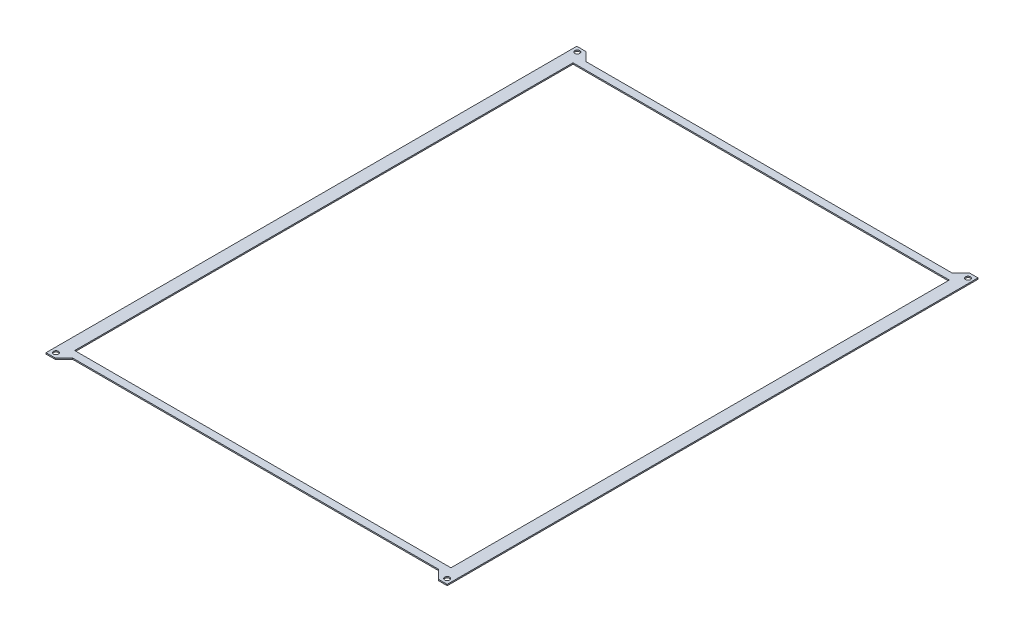
ISO-10303-21;
HEADER;
FILE_DESCRIPTION(('STEP AP214'),'2;1');
FILE_NAME('part.step','',(''),(''),'','','');
FILE_SCHEMA(('AUTOMOTIVE_DESIGN { 1 0 10303 214 1 1 1 1 }'));
ENDSEC;
DATA;
#1=APPLICATION_CONTEXT('core data for automotive mechanical design processes');
#2=APPLICATION_PROTOCOL_DEFINITION('international standard','automotive_design',2000,#1);
#3=PRODUCT_CONTEXT('',#1,'mechanical');
#4=PRODUCT('Part','Part','',(#3));
#5=PRODUCT_RELATED_PRODUCT_CATEGORY('part','',(#4));
#6=PRODUCT_DEFINITION_FORMATION('','',#4);
#7=PRODUCT_DEFINITION_CONTEXT('part definition',#1,'design');
#8=PRODUCT_DEFINITION('design','',#6,#7);
#9=PRODUCT_DEFINITION_SHAPE('','',#8);
#10=(LENGTH_UNIT() NAMED_UNIT(*) SI_UNIT(.MILLI.,.METRE.));
#11=(NAMED_UNIT(*) PLANE_ANGLE_UNIT() SI_UNIT($,.RADIAN.));
#12=(NAMED_UNIT(*) SI_UNIT($,.STERADIAN.) SOLID_ANGLE_UNIT());
#13=UNCERTAINTY_MEASURE_WITH_UNIT(LENGTH_MEASURE(1.E-05),#10,'distance_accuracy_value','');
#14=(GEOMETRIC_REPRESENTATION_CONTEXT(3) GLOBAL_UNCERTAINTY_ASSIGNED_CONTEXT((#13)) GLOBAL_UNIT_ASSIGNED_CONTEXT((#10,
#11,#12)) REPRESENTATION_CONTEXT('',''));
#15=CARTESIAN_POINT('',(0.,0.,0.));
#16=DIRECTION('',(0.,0.,1.));
#17=DIRECTION('',(1.,0.,0.));
#18=AXIS2_PLACEMENT_3D('',#15,#16,#17);
#19=CARTESIAN_POINT('',(0.,0.5,0.));
#20=DIRECTION('',(0.,-1.,0.));
#21=DIRECTION('',(0.,0.,-1.));
#22=AXIS2_PLACEMENT_3D('',#19,#20,#21);
#23=PLANE('',#22);
#24=CARTESIAN_POINT('',(78.6297530458882,0.5,-104.402403880096));
#25=DIRECTION('',(0.,1.,0.));
#26=DIRECTION('',(0.,0.,-1.));
#27=AXIS2_PLACEMENT_3D('',#24,#25,#26);
#28=CIRCLE('',#27,0.999999999999989);
#29=CARTESIAN_POINT('',(78.6297530458882,0.5,-105.402403880096));
#30=VERTEX_POINT('',#29);
#31=EDGE_CURVE('E534',#30,#30,#28,.T.);
#32=ORIENTED_EDGE('',*,*,#31,.F.);
#33=EDGE_LOOP('',(#32));
#34=FACE_BOUND('',#33,.T.);
#35=CARTESIAN_POINT('',(-78.5,0.5,104.5));
#36=DIRECTION('',(0.,1.,0.));
#37=DIRECTION('',(0.,0.,1.));
#38=AXIS2_PLACEMENT_3D('',#35,#36,#37);
#39=CIRCLE('',#38,0.999999999999998);
#40=CARTESIAN_POINT('',(-78.5,0.5,105.5));
#41=VERTEX_POINT('',#40);
#42=EDGE_CURVE('E177',#41,#41,#39,.T.);
#43=ORIENTED_EDGE('',*,*,#42,.F.);
#44=EDGE_LOOP('',(#43));
#45=FACE_BOUND('',#44,.T.);
#46=DIRECTION('',(-1.,0.,0.));
#47=VECTOR('',#46,1.);
#48=CARTESIAN_POINT('',(-80.5,0.5,-106.5));
#49=LINE('',#48,#47);
#50=CARTESIAN_POINT('',(-76.9,0.5,-106.5));
#51=VERTEX_POINT('',#50);
#52=CARTESIAN_POINT('',(-80.5,0.5,-106.5));
#53=VERTEX_POINT('',#52);
#54=EDGE_CURVE('E187',#51,#53,#49,.T.);
#55=ORIENTED_EDGE('',*,*,#54,.T.);
#56=DIRECTION('',(0.,0.,1.));
#57=VECTOR('',#56,1.);
#58=CARTESIAN_POINT('',(-80.5,0.5,106.4));
#59=LINE('',#58,#57);
#60=CARTESIAN_POINT('',(-80.5,0.5,106.5));
#61=VERTEX_POINT('',#60);
#62=EDGE_CURVE('E190',#53,#61,#59,.T.);
#63=ORIENTED_EDGE('',*,*,#62,.T.);
#64=DIRECTION('',(1.,0.,2.77555756156243E-13));
#65=VECTOR('',#64,1.);
#66=CARTESIAN_POINT('',(-80.5,0.5,106.5));
#67=LINE('',#66,#65);
#68=CARTESIAN_POINT('',(-76.9,0.5,106.5));
#69=VERTEX_POINT('',#68);
#70=EDGE_CURVE('E193',#61,#69,#67,.T.);
#71=ORIENTED_EDGE('',*,*,#70,.T.);
#72=DIRECTION('',(0.707106781186546,0.,-0.707106781186549));
#73=VECTOR('',#72,1.);
#74=CARTESIAN_POINT('',(-73.4,0.5,103.));
#75=LINE('',#74,#73);
#76=CARTESIAN_POINT('',(-73.4,0.5,103.));
#77=VERTEX_POINT('',#76);
#78=EDGE_CURVE('E195',#69,#77,#75,.T.);
#79=ORIENTED_EDGE('',*,*,#78,.T.);
#80=DIRECTION('',(1.,0.,0.));
#81=VECTOR('',#80,1.);
#82=CARTESIAN_POINT('',(73.5,0.5,103.));
#83=LINE('',#82,#81);
#84=CARTESIAN_POINT('',(73.5,0.5,103.));
#85=VERTEX_POINT('',#84);
#86=EDGE_CURVE('E197',#77,#85,#83,.T.);
#87=ORIENTED_EDGE('',*,*,#86,.T.);
#88=DIRECTION('',(0.707106781186547,0.,0.707106781186547));
#89=VECTOR('',#88,1.);
#90=CARTESIAN_POINT('',(77.,0.5,106.5));
#91=LINE('',#90,#89);
#92=CARTESIAN_POINT('',(77.,0.5,106.5));
#93=VERTEX_POINT('',#92);
#94=EDGE_CURVE('E199',#85,#93,#91,.T.);
#95=ORIENTED_EDGE('',*,*,#94,.T.);
#96=DIRECTION('',(1.,0.,0.));
#97=VECTOR('',#96,1.);
#98=CARTESIAN_POINT('',(80.5,0.5,106.5));
#99=LINE('',#98,#97);
#100=CARTESIAN_POINT('',(80.5,0.5,106.5));
#101=VERTEX_POINT('',#100);
#102=EDGE_CURVE('E201',#93,#101,#99,.T.);
#103=ORIENTED_EDGE('',*,*,#102,.T.);
#104=DIRECTION('',(0.,0.,-1.));
#105=VECTOR('',#104,1.);
#106=CARTESIAN_POINT('',(80.5,0.5,-106.5));
#107=LINE('',#106,#105);
#108=CARTESIAN_POINT('',(80.5,0.5,-106.5));
#109=VERTEX_POINT('',#108);
#110=EDGE_CURVE('E203',#101,#109,#107,.T.);
#111=ORIENTED_EDGE('',*,*,#110,.T.);
#112=DIRECTION('',(-1.,0.,0.));
#113=VECTOR('',#112,1.);
#114=CARTESIAN_POINT('',(77.,0.5,-106.5));
#115=LINE('',#114,#113);
#116=CARTESIAN_POINT('',(77.,0.5,-106.5));
#117=VERTEX_POINT('',#116);
#118=EDGE_CURVE('E205',#109,#117,#115,.T.);
#119=ORIENTED_EDGE('',*,*,#118,.T.);
#120=DIRECTION('',(-0.707106781186547,0.,0.707106781186547));
#121=VECTOR('',#120,1.);
#122=CARTESIAN_POINT('',(73.5,0.5,-103.));
#123=LINE('',#122,#121);
#124=CARTESIAN_POINT('',(73.5,0.5,-103.));
#125=VERTEX_POINT('',#124);
#126=EDGE_CURVE('E207',#117,#125,#123,.T.);
#127=ORIENTED_EDGE('',*,*,#126,.T.);
#128=DIRECTION('',(-1.,0.,0.));
#129=VECTOR('',#128,1.);
#130=CARTESIAN_POINT('',(-73.4,0.5,-103.));
#131=LINE('',#130,#129);
#132=CARTESIAN_POINT('',(-73.4,0.5,-103.));
#133=VERTEX_POINT('',#132);
#134=EDGE_CURVE('E209',#125,#133,#131,.T.);
#135=ORIENTED_EDGE('',*,*,#134,.T.);
#136=DIRECTION('',(-0.707106781186549,0.,-0.707106781186546));
#137=VECTOR('',#136,1.);
#138=CARTESIAN_POINT('',(-76.9,0.5,-106.5));
#139=LINE('',#138,#137);
#140=EDGE_CURVE('E211',#133,#51,#139,.T.);
#141=ORIENTED_EDGE('',*,*,#140,.T.);
#142=EDGE_LOOP('',(#55,#63,#71,#79,#87,#95,#103,#111,#119,#127,#135,#141));
#143=FACE_BOUND('',#142,.T.);
#144=DIRECTION('',(0.,0.,1.));
#145=VECTOR('',#144,1.);
#146=CARTESIAN_POINT('',(-75.5,0.5,100.));
#147=LINE('',#146,#145);
#148=CARTESIAN_POINT('',(-75.5,0.5,-100.));
#149=VERTEX_POINT('',#148);
#150=CARTESIAN_POINT('',(-75.5,0.5,100.));
#151=VERTEX_POINT('',#150);
#152=EDGE_CURVE('E148',#149,#151,#147,.T.);
#153=ORIENTED_EDGE('',*,*,#152,.F.);
#154=DIRECTION('',(-1.,0.,0.));
#155=VECTOR('',#154,1.);
#156=CARTESIAN_POINT('',(-75.5,0.5,-100.));
#157=LINE('',#156,#155);
#158=CARTESIAN_POINT('',(75.5,0.5,-100.));
#159=VERTEX_POINT('',#158);
#160=EDGE_CURVE('E171',#159,#149,#157,.T.);
#161=ORIENTED_EDGE('',*,*,#160,.F.);
#162=DIRECTION('',(0.,0.,-1.));
#163=VECTOR('',#162,1.);
#164=CARTESIAN_POINT('',(75.5,0.5,-100.));
#165=LINE('',#164,#163);
#166=CARTESIAN_POINT('',(75.5,0.5,100.));
#167=VERTEX_POINT('',#166);
#168=EDGE_CURVE('E169',#167,#159,#165,.T.);
#169=ORIENTED_EDGE('',*,*,#168,.F.);
#170=DIRECTION('',(1.,0.,0.));
#171=VECTOR('',#170,1.);
#172=CARTESIAN_POINT('',(75.5,0.5,100.));
#173=LINE('',#172,#171);
#174=EDGE_CURVE('E156',#151,#167,#173,.T.);
#175=ORIENTED_EDGE('',*,*,#174,.F.);
#176=EDGE_LOOP('',(#153,#161,#169,#175));
#177=FACE_BOUND('',#176,.T.);
#178=CARTESIAN_POINT('',(78.5,0.5,104.5));
#179=DIRECTION('',(0.,1.,0.));
#180=DIRECTION('',(0.,0.,1.));
#181=AXIS2_PLACEMENT_3D('',#178,#179,#180);
#182=CIRCLE('',#181,0.999999999999998);
#183=CARTESIAN_POINT('',(78.5,0.5,105.5));
#184=VERTEX_POINT('',#183);
#185=EDGE_CURVE('E540',#184,#184,#182,.T.);
#186=ORIENTED_EDGE('',*,*,#185,.F.);
#187=EDGE_LOOP('',(#186));
#188=FACE_BOUND('',#187,.T.);
#189=CARTESIAN_POINT('',(-78.3701258168567,0.5,-104.597434860756));
#190=DIRECTION('',(0.,1.,0.));
#191=DIRECTION('',(0.,0.,-1.));
#192=AXIS2_PLACEMENT_3D('',#189,#190,#191);
#193=CIRCLE('',#192,0.999999999999962);
#194=CARTESIAN_POINT('',(-78.3701258168567,0.5,-105.597434860756));
#195=VERTEX_POINT('',#194);
#196=EDGE_CURVE('E525',#195,#195,#193,.T.);
#197=ORIENTED_EDGE('',*,*,#196,.F.);
#198=EDGE_LOOP('',(#197));
#199=FACE_BOUND('',#198,.T.);
#200=ADVANCED_FACE('F35',(#34,#45,#143,#177,#188,#199),#23,.F.);
#201=CARTESIAN_POINT('',(0.,0.,0.));
#202=DIRECTION('',(0.,-1.,0.));
#203=DIRECTION('',(0.,0.,-1.));
#204=AXIS2_PLACEMENT_3D('',#201,#202,#203);
#205=PLANE('',#204);
#206=CARTESIAN_POINT('',(78.6297530458882,0.,-104.402403880096));
#207=DIRECTION('',(0.,1.,0.));
#208=DIRECTION('',(0.,0.,-1.));
#209=AXIS2_PLACEMENT_3D('',#206,#207,#208);
#210=CIRCLE('',#209,0.999999999999989);
#211=CARTESIAN_POINT('',(78.6297530458882,0.,-105.402403880096));
#212=VERTEX_POINT('',#211);
#213=EDGE_CURVE('E531',#212,#212,#210,.T.);
#214=ORIENTED_EDGE('',*,*,#213,.T.);
#215=EDGE_LOOP('',(#214));
#216=FACE_BOUND('',#215,.T.);
#217=CARTESIAN_POINT('',(-78.5,0.,104.5));
#218=DIRECTION('',(0.,1.,0.));
#219=DIRECTION('',(0.,0.,1.));
#220=AXIS2_PLACEMENT_3D('',#217,#218,#219);
#221=CIRCLE('',#220,0.999999999999998);
#222=CARTESIAN_POINT('',(-78.5,0.,105.5));
#223=VERTEX_POINT('',#222);
#224=EDGE_CURVE('E543',#223,#223,#221,.T.);
#225=ORIENTED_EDGE('',*,*,#224,.T.);
#226=EDGE_LOOP('',(#225));
#227=FACE_BOUND('',#226,.T.);
#228=DIRECTION('',(-1.,0.,0.));
#229=VECTOR('',#228,1.);
#230=CARTESIAN_POINT('',(-80.5,0.,-106.5));
#231=LINE('',#230,#229);
#232=CARTESIAN_POINT('',(-76.9,0.,-106.5));
#233=VERTEX_POINT('',#232);
#234=CARTESIAN_POINT('',(-80.5,0.,-106.5));
#235=VERTEX_POINT('',#234);
#236=EDGE_CURVE('E164',#233,#235,#231,.T.);
#237=ORIENTED_EDGE('',*,*,#236,.F.);
#238=DIRECTION('',(-0.707106781186549,0.,-0.707106781186546));
#239=VECTOR('',#238,1.);
#240=CARTESIAN_POINT('',(-76.9,0.,-106.5));
#241=LINE('',#240,#239);
#242=CARTESIAN_POINT('',(-73.4,0.,-103.));
#243=VERTEX_POINT('',#242);
#244=EDGE_CURVE('E191',#243,#233,#241,.T.);
#245=ORIENTED_EDGE('',*,*,#244,.F.);
#246=DIRECTION('',(-1.,0.,0.));
#247=VECTOR('',#246,1.);
#248=CARTESIAN_POINT('',(-73.4,0.,-103.));
#249=LINE('',#248,#247);
#250=CARTESIAN_POINT('',(73.5,0.,-103.));
#251=VERTEX_POINT('',#250);
#252=EDGE_CURVE('E235',#251,#243,#249,.T.);
#253=ORIENTED_EDGE('',*,*,#252,.F.);
#254=DIRECTION('',(-0.707106781186547,0.,0.707106781186547));
#255=VECTOR('',#254,1.);
#256=CARTESIAN_POINT('',(73.5,0.,-103.));
#257=LINE('',#256,#255);
#258=CARTESIAN_POINT('',(77.,0.,-106.5));
#259=VERTEX_POINT('',#258);
#260=EDGE_CURVE('E233',#259,#251,#257,.T.);
#261=ORIENTED_EDGE('',*,*,#260,.F.);
#262=DIRECTION('',(-1.,0.,0.));
#263=VECTOR('',#262,1.);
#264=CARTESIAN_POINT('',(77.,0.,-106.5));
#265=LINE('',#264,#263);
#266=CARTESIAN_POINT('',(80.5,0.,-106.5));
#267=VERTEX_POINT('',#266);
#268=EDGE_CURVE('E231',#267,#259,#265,.T.);
#269=ORIENTED_EDGE('',*,*,#268,.F.);
#270=DIRECTION('',(0.,0.,-1.));
#271=VECTOR('',#270,1.);
#272=CARTESIAN_POINT('',(80.5,0.,-106.5));
#273=LINE('',#272,#271);
#274=CARTESIAN_POINT('',(80.5,0.,106.5));
#275=VERTEX_POINT('',#274);
#276=EDGE_CURVE('E229',#275,#267,#273,.T.);
#277=ORIENTED_EDGE('',*,*,#276,.F.);
#278=DIRECTION('',(1.,0.,0.));
#279=VECTOR('',#278,1.);
#280=CARTESIAN_POINT('',(80.5,0.,106.5));
#281=LINE('',#280,#279);
#282=CARTESIAN_POINT('',(77.,0.,106.5));
#283=VERTEX_POINT('',#282);
#284=EDGE_CURVE('E227',#283,#275,#281,.T.);
#285=ORIENTED_EDGE('',*,*,#284,.F.);
#286=DIRECTION('',(0.707106781186547,0.,0.707106781186547));
#287=VECTOR('',#286,1.);
#288=CARTESIAN_POINT('',(77.,0.,106.5));
#289=LINE('',#288,#287);
#290=CARTESIAN_POINT('',(73.5,0.,103.));
#291=VERTEX_POINT('',#290);
#292=EDGE_CURVE('E225',#291,#283,#289,.T.);
#293=ORIENTED_EDGE('',*,*,#292,.F.);
#294=DIRECTION('',(1.,0.,0.));
#295=VECTOR('',#294,1.);
#296=CARTESIAN_POINT('',(73.5,0.,103.));
#297=LINE('',#296,#295);
#298=CARTESIAN_POINT('',(-73.4,0.,103.));
#299=VERTEX_POINT('',#298);
#300=EDGE_CURVE('E223',#299,#291,#297,.T.);
#301=ORIENTED_EDGE('',*,*,#300,.F.);
#302=DIRECTION('',(0.707106781186546,0.,-0.707106781186549));
#303=VECTOR('',#302,1.);
#304=CARTESIAN_POINT('',(-73.4,0.,103.));
#305=LINE('',#304,#303);
#306=CARTESIAN_POINT('',(-76.9,0.,106.5));
#307=VERTEX_POINT('',#306);
#308=EDGE_CURVE('E221',#307,#299,#305,.T.);
#309=ORIENTED_EDGE('',*,*,#308,.F.);
#310=DIRECTION('',(1.,0.,0.));
#311=VECTOR('',#310,1.);
#312=CARTESIAN_POINT('',(-76.9,0.,106.5));
#313=LINE('',#312,#311);
#314=CARTESIAN_POINT('',(-80.5,0.,106.5));
#315=VERTEX_POINT('',#314);
#316=EDGE_CURVE('E219',#315,#307,#313,.T.);
#317=ORIENTED_EDGE('',*,*,#316,.F.);
#318=DIRECTION('',(0.,0.,1.));
#319=VECTOR('',#318,1.);
#320=CARTESIAN_POINT('',(-80.5,0.,106.4));
#321=LINE('',#320,#319);
#322=EDGE_CURVE('E216',#235,#315,#321,.T.);
#323=ORIENTED_EDGE('',*,*,#322,.F.);
#324=EDGE_LOOP('',(#237,#245,#253,#261,#269,#277,#285,#293,#301,#309,#317,#323));
#325=FACE_BOUND('',#324,.T.);
#326=DIRECTION('',(-1.,0.,0.));
#327=VECTOR('',#326,1.);
#328=CARTESIAN_POINT('',(-75.5,0.,-100.));
#329=LINE('',#328,#327);
#330=CARTESIAN_POINT('',(75.5,0.,-100.));
#331=VERTEX_POINT('',#330);
#332=CARTESIAN_POINT('',(-75.5,0.,-100.));
#333=VERTEX_POINT('',#332);
#334=EDGE_CURVE('E157',#331,#333,#329,.T.);
#335=ORIENTED_EDGE('',*,*,#334,.T.);
#336=DIRECTION('',(0.,0.,1.));
#337=VECTOR('',#336,1.);
#338=CARTESIAN_POINT('',(-75.5,0.,100.));
#339=LINE('',#338,#337);
#340=CARTESIAN_POINT('',(-75.5,0.,100.));
#341=VERTEX_POINT('',#340);
#342=EDGE_CURVE('E58',#333,#341,#339,.T.);
#343=ORIENTED_EDGE('',*,*,#342,.T.);
#344=DIRECTION('',(1.,0.,0.));
#345=VECTOR('',#344,1.);
#346=CARTESIAN_POINT('',(75.5,0.,100.));
#347=LINE('',#346,#345);
#348=CARTESIAN_POINT('',(75.5,0.,100.));
#349=VERTEX_POINT('',#348);
#350=EDGE_CURVE('E163',#341,#349,#347,.T.);
#351=ORIENTED_EDGE('',*,*,#350,.T.);
#352=DIRECTION('',(0.,0.,-1.));
#353=VECTOR('',#352,1.);
#354=CARTESIAN_POINT('',(75.5,0.,-100.));
#355=LINE('',#354,#353);
#356=EDGE_CURVE('E179',#349,#331,#355,.T.);
#357=ORIENTED_EDGE('',*,*,#356,.T.);
#358=EDGE_LOOP('',(#335,#343,#351,#357));
#359=FACE_BOUND('',#358,.T.);
#360=CARTESIAN_POINT('',(78.5,0.,104.5));
#361=DIRECTION('',(0.,1.,0.));
#362=DIRECTION('',(0.,0.,1.));
#363=AXIS2_PLACEMENT_3D('',#360,#361,#362);
#364=CIRCLE('',#363,0.999999999999998);
#365=CARTESIAN_POINT('',(78.5,0.,105.5));
#366=VERTEX_POINT('',#365);
#367=EDGE_CURVE('E537',#366,#366,#364,.T.);
#368=ORIENTED_EDGE('',*,*,#367,.T.);
#369=EDGE_LOOP('',(#368));
#370=FACE_BOUND('',#369,.T.);
#371=CARTESIAN_POINT('',(-78.3701258168567,0.,-104.597434860756));
#372=DIRECTION('',(0.,1.,0.));
#373=DIRECTION('',(0.,0.,-1.));
#374=AXIS2_PLACEMENT_3D('',#371,#372,#373);
#375=CIRCLE('',#374,0.999999999999962);
#376=CARTESIAN_POINT('',(-78.3701258168567,0.,-105.597434860756));
#377=VERTEX_POINT('',#376);
#378=EDGE_CURVE('E528',#377,#377,#375,.T.);
#379=ORIENTED_EDGE('',*,*,#378,.T.);
#380=EDGE_LOOP('',(#379));
#381=FACE_BOUND('',#380,.T.);
#382=ADVANCED_FACE('F277',(#216,#227,#325,#359,#370,#381),#205,.T.);
#383=CARTESIAN_POINT('',(-80.5,0.5,-106.5));
#384=DIRECTION('',(0.,0.,1.));
#385=DIRECTION('',(1.,0.,0.));
#386=AXIS2_PLACEMENT_3D('',#383,#384,#385);
#387=PLANE('',#386);
#388=ORIENTED_EDGE('',*,*,#236,.T.);
#389=DIRECTION('',(0.,-1.,0.));
#390=VECTOR('',#389,1.);
#391=CARTESIAN_POINT('',(-80.5,0.5,-106.5));
#392=LINE('',#391,#390);
#393=EDGE_CURVE('E11',#53,#235,#392,.T.);
#394=ORIENTED_EDGE('',*,*,#393,.F.);
#395=ORIENTED_EDGE('',*,*,#54,.F.);
#396=DIRECTION('',(0.,-1.,0.));
#397=VECTOR('',#396,1.);
#398=CARTESIAN_POINT('',(-76.9,0.5,-106.5));
#399=LINE('',#398,#397);
#400=EDGE_CURVE('E213',#51,#233,#399,.T.);
#401=ORIENTED_EDGE('',*,*,#400,.T.);
#402=EDGE_LOOP('',(#388,#394,#395,#401));
#403=FACE_BOUND('',#402,.T.);
#404=ADVANCED_FACE('F37',(#403),#387,.F.);
#405=CARTESIAN_POINT('',(-80.5,0.5,106.4));
#406=DIRECTION('',(1.,0.,0.));
#407=DIRECTION('',(0.,0.,-1.));
#408=AXIS2_PLACEMENT_3D('',#405,#406,#407);
#409=PLANE('',#408);
#410=ORIENTED_EDGE('',*,*,#322,.T.);
#411=DIRECTION('',(0.,-1.,0.));
#412=VECTOR('',#411,1.);
#413=CARTESIAN_POINT('',(-80.5,0.5,106.5));
#414=LINE('',#413,#412);
#415=EDGE_CURVE('E43',#61,#315,#414,.T.);
#416=ORIENTED_EDGE('',*,*,#415,.F.);
#417=ORIENTED_EDGE('',*,*,#62,.F.);
#418=ORIENTED_EDGE('',*,*,#393,.T.);
#419=EDGE_LOOP('',(#410,#416,#417,#418));
#420=FACE_BOUND('',#419,.T.);
#421=ADVANCED_FACE('F273',(#420),#409,.F.);
#422=CARTESIAN_POINT('',(-76.9,0.5,106.5));
#423=DIRECTION('',(0.,0.,-1.));
#424=DIRECTION('',(-1.,0.,0.));
#425=AXIS2_PLACEMENT_3D('',#422,#423,#424);
#426=PLANE('',#425);
#427=ORIENTED_EDGE('',*,*,#316,.T.);
#428=DIRECTION('',(0.,-1.,0.));
#429=VECTOR('',#428,1.);
#430=CARTESIAN_POINT('',(-76.9,0.5,106.5));
#431=LINE('',#430,#429);
#432=EDGE_CURVE('E264',#69,#307,#431,.T.);
#433=ORIENTED_EDGE('',*,*,#432,.F.);
#434=ORIENTED_EDGE('',*,*,#70,.F.);
#435=ORIENTED_EDGE('',*,*,#415,.T.);
#436=EDGE_LOOP('',(#427,#433,#434,#435));
#437=FACE_BOUND('',#436,.T.);
#438=ADVANCED_FACE('F270',(#437),#426,.F.);
#439=CARTESIAN_POINT('',(-73.4,0.5,103.));
#440=DIRECTION('',(-0.707106781186549,0.,-0.707106781186546));
#441=DIRECTION('',(-0.707106781186546,0.,0.707106781186549));
#442=AXIS2_PLACEMENT_3D('',#439,#440,#441);
#443=PLANE('',#442);
#444=ORIENTED_EDGE('',*,*,#308,.T.);
#445=DIRECTION('',(0.,-1.,0.));
#446=VECTOR('',#445,1.);
#447=CARTESIAN_POINT('',(-73.4,0.5,103.));
#448=LINE('',#447,#446);
#449=EDGE_CURVE('E261',#77,#299,#448,.T.);
#450=ORIENTED_EDGE('',*,*,#449,.F.);
#451=ORIENTED_EDGE('',*,*,#78,.F.);
#452=ORIENTED_EDGE('',*,*,#432,.T.);
#453=EDGE_LOOP('',(#444,#450,#451,#452));
#454=FACE_BOUND('',#453,.T.);
#455=ADVANCED_FACE('F285',(#454),#443,.F.);
#456=CARTESIAN_POINT('',(73.5,0.5,103.));
#457=DIRECTION('',(0.,0.,-1.));
#458=DIRECTION('',(-1.,0.,0.));
#459=AXIS2_PLACEMENT_3D('',#456,#457,#458);
#460=PLANE('',#459);
#461=ORIENTED_EDGE('',*,*,#300,.T.);
#462=DIRECTION('',(0.,-1.,0.));
#463=VECTOR('',#462,1.);
#464=CARTESIAN_POINT('',(73.5,0.5,103.));
#465=LINE('',#464,#463);
#466=EDGE_CURVE('E258',#85,#291,#465,.T.);
#467=ORIENTED_EDGE('',*,*,#466,.F.);
#468=ORIENTED_EDGE('',*,*,#86,.F.);
#469=ORIENTED_EDGE('',*,*,#449,.T.);
#470=EDGE_LOOP('',(#461,#467,#468,#469));
#471=FACE_BOUND('',#470,.T.);
#472=ADVANCED_FACE('F289',(#471),#460,.F.);
#473=CARTESIAN_POINT('',(77.,0.5,106.5));
#474=DIRECTION('',(0.707106781186547,0.,-0.707106781186547));
#475=DIRECTION('',(-0.707106781186548,0.,-0.707106781186548));
#476=AXIS2_PLACEMENT_3D('',#473,#474,#475);
#477=PLANE('',#476);
#478=ORIENTED_EDGE('',*,*,#292,.T.);
#479=DIRECTION('',(0.,-1.,0.));
#480=VECTOR('',#479,1.);
#481=CARTESIAN_POINT('',(77.,0.5,106.5));
#482=LINE('',#481,#480);
#483=EDGE_CURVE('E255',#93,#283,#482,.T.);
#484=ORIENTED_EDGE('',*,*,#483,.F.);
#485=ORIENTED_EDGE('',*,*,#94,.F.);
#486=ORIENTED_EDGE('',*,*,#466,.T.);
#487=EDGE_LOOP('',(#478,#484,#485,#486));
#488=FACE_BOUND('',#487,.T.);
#489=ADVANCED_FACE('F326',(#488),#477,.F.);
#490=CARTESIAN_POINT('',(80.5,0.5,106.5));
#491=DIRECTION('',(0.,0.,-1.));
#492=DIRECTION('',(-1.,0.,0.));
#493=AXIS2_PLACEMENT_3D('',#490,#491,#492);
#494=PLANE('',#493);
#495=ORIENTED_EDGE('',*,*,#284,.T.);
#496=DIRECTION('',(0.,-1.,0.));
#497=VECTOR('',#496,1.);
#498=CARTESIAN_POINT('',(80.5,0.5,106.5));
#499=LINE('',#498,#497);
#500=EDGE_CURVE('E252',#101,#275,#499,.T.);
#501=ORIENTED_EDGE('',*,*,#500,.F.);
#502=ORIENTED_EDGE('',*,*,#102,.F.);
#503=ORIENTED_EDGE('',*,*,#483,.T.);
#504=EDGE_LOOP('',(#495,#501,#502,#503));
#505=FACE_BOUND('',#504,.T.);
#506=ADVANCED_FACE('F324',(#505),#494,.F.);
#507=CARTESIAN_POINT('',(80.5,0.5,-106.5));
#508=DIRECTION('',(-1.,0.,0.));
#509=DIRECTION('',(0.,0.,1.));
#510=AXIS2_PLACEMENT_3D('',#507,#508,#509);
#511=PLANE('',#510);
#512=ORIENTED_EDGE('',*,*,#276,.T.);
#513=DIRECTION('',(0.,-1.,0.));
#514=VECTOR('',#513,1.);
#515=CARTESIAN_POINT('',(80.5,0.5,-106.5));
#516=LINE('',#515,#514);
#517=EDGE_CURVE('E249',#109,#267,#516,.T.);
#518=ORIENTED_EDGE('',*,*,#517,.F.);
#519=ORIENTED_EDGE('',*,*,#110,.F.);
#520=ORIENTED_EDGE('',*,*,#500,.T.);
#521=EDGE_LOOP('',(#512,#518,#519,#520));
#522=FACE_BOUND('',#521,.T.);
#523=ADVANCED_FACE('F319',(#522),#511,.F.);
#524=CARTESIAN_POINT('',(77.,0.5,-106.5));
#525=DIRECTION('',(0.,0.,1.));
#526=DIRECTION('',(1.,0.,0.));
#527=AXIS2_PLACEMENT_3D('',#524,#525,#526);
#528=PLANE('',#527);
#529=ORIENTED_EDGE('',*,*,#268,.T.);
#530=DIRECTION('',(0.,-1.,0.));
#531=VECTOR('',#530,1.);
#532=CARTESIAN_POINT('',(77.,0.5,-106.5));
#533=LINE('',#532,#531);
#534=EDGE_CURVE('E246',#117,#259,#533,.T.);
#535=ORIENTED_EDGE('',*,*,#534,.F.);
#536=ORIENTED_EDGE('',*,*,#118,.F.);
#537=ORIENTED_EDGE('',*,*,#517,.T.);
#538=EDGE_LOOP('',(#529,#535,#536,#537));
#539=FACE_BOUND('',#538,.T.);
#540=ADVANCED_FACE('F314',(#539),#528,.F.);
#541=CARTESIAN_POINT('',(73.5,0.5,-103.));
#542=DIRECTION('',(0.707106781186547,0.,0.707106781186547));
#543=DIRECTION('',(0.707106781186548,0.,-0.707106781186548));
#544=AXIS2_PLACEMENT_3D('',#541,#542,#543);
#545=PLANE('',#544);
#546=ORIENTED_EDGE('',*,*,#260,.T.);
#547=DIRECTION('',(0.,-1.,0.));
#548=VECTOR('',#547,1.);
#549=CARTESIAN_POINT('',(73.5,0.5,-103.));
#550=LINE('',#549,#548);
#551=EDGE_CURVE('E243',#125,#251,#550,.T.);
#552=ORIENTED_EDGE('',*,*,#551,.F.);
#553=ORIENTED_EDGE('',*,*,#126,.F.);
#554=ORIENTED_EDGE('',*,*,#534,.T.);
#555=EDGE_LOOP('',(#546,#552,#553,#554));
#556=FACE_BOUND('',#555,.T.);
#557=ADVANCED_FACE('F310',(#556),#545,.F.);
#558=CARTESIAN_POINT('',(-73.4,0.5,-103.));
#559=DIRECTION('',(0.,0.,1.));
#560=DIRECTION('',(1.,0.,0.));
#561=AXIS2_PLACEMENT_3D('',#558,#559,#560);
#562=PLANE('',#561);
#563=ORIENTED_EDGE('',*,*,#252,.T.);
#564=DIRECTION('',(0.,-1.,0.));
#565=VECTOR('',#564,1.);
#566=CARTESIAN_POINT('',(-73.4,0.5,-103.));
#567=LINE('',#566,#565);
#568=EDGE_CURVE('E240',#133,#243,#567,.T.);
#569=ORIENTED_EDGE('',*,*,#568,.F.);
#570=ORIENTED_EDGE('',*,*,#134,.F.);
#571=ORIENTED_EDGE('',*,*,#551,.T.);
#572=EDGE_LOOP('',(#563,#569,#570,#571));
#573=FACE_BOUND('',#572,.T.);
#574=ADVANCED_FACE('F305',(#573),#562,.F.);
#575=CARTESIAN_POINT('',(-76.9,0.5,-106.5));
#576=DIRECTION('',(-0.707106781186546,0.,0.707106781186549));
#577=DIRECTION('',(0.707106781186549,0.,0.707106781186546));
#578=AXIS2_PLACEMENT_3D('',#575,#576,#577);
#579=PLANE('',#578);
#580=ORIENTED_EDGE('',*,*,#244,.T.);
#581=ORIENTED_EDGE('',*,*,#400,.F.);
#582=ORIENTED_EDGE('',*,*,#140,.F.);
#583=ORIENTED_EDGE('',*,*,#568,.T.);
#584=EDGE_LOOP('',(#580,#581,#582,#583));
#585=FACE_BOUND('',#584,.T.);
#586=ADVANCED_FACE('F299',(#585),#579,.F.);
#587=CARTESIAN_POINT('',(-75.5,0.5,100.));
#588=DIRECTION('',(1.,0.,0.));
#589=DIRECTION('',(0.,0.,-1.));
#590=AXIS2_PLACEMENT_3D('',#587,#588,#589);
#591=PLANE('',#590);
#592=ORIENTED_EDGE('',*,*,#342,.F.);
#593=DIRECTION('',(0.,-1.,0.));
#594=VECTOR('',#593,1.);
#595=CARTESIAN_POINT('',(-75.5,0.5,-100.));
#596=LINE('',#595,#594);
#597=EDGE_CURVE('E152',#149,#333,#596,.T.);
#598=ORIENTED_EDGE('',*,*,#597,.F.);
#599=ORIENTED_EDGE('',*,*,#152,.T.);
#600=DIRECTION('',(0.,-1.,0.));
#601=VECTOR('',#600,1.);
#602=CARTESIAN_POINT('',(-75.5,0.5,100.));
#603=LINE('',#602,#601);
#604=EDGE_CURVE('E151',#151,#341,#603,.T.);
#605=ORIENTED_EDGE('',*,*,#604,.T.);
#606=EDGE_LOOP('',(#592,#598,#599,#605));
#607=FACE_BOUND('',#606,.T.);
#608=ADVANCED_FACE('F150',(#607),#591,.T.);
#609=CARTESIAN_POINT('',(75.5,0.5,100.));
#610=DIRECTION('',(0.,0.,-1.));
#611=DIRECTION('',(-1.,0.,0.));
#612=AXIS2_PLACEMENT_3D('',#609,#610,#611);
#613=PLANE('',#612);
#614=ORIENTED_EDGE('',*,*,#350,.F.);
#615=ORIENTED_EDGE('',*,*,#604,.F.);
#616=ORIENTED_EDGE('',*,*,#174,.T.);
#617=DIRECTION('',(0.,-1.,0.));
#618=VECTOR('',#617,1.);
#619=CARTESIAN_POINT('',(75.5,0.5,100.));
#620=LINE('',#619,#618);
#621=EDGE_CURVE('E165',#167,#349,#620,.T.);
#622=ORIENTED_EDGE('',*,*,#621,.T.);
#623=EDGE_LOOP('',(#614,#615,#616,#622));
#624=FACE_BOUND('',#623,.T.);
#625=ADVANCED_FACE('F160',(#624),#613,.T.);
#626=CARTESIAN_POINT('',(75.5,0.5,-100.));
#627=DIRECTION('',(-1.,0.,0.));
#628=DIRECTION('',(0.,0.,1.));
#629=AXIS2_PLACEMENT_3D('',#626,#627,#628);
#630=PLANE('',#629);
#631=ORIENTED_EDGE('',*,*,#356,.F.);
#632=ORIENTED_EDGE('',*,*,#621,.F.);
#633=ORIENTED_EDGE('',*,*,#168,.T.);
#634=DIRECTION('',(0.,-1.,0.));
#635=VECTOR('',#634,1.);
#636=CARTESIAN_POINT('',(75.5,0.5,-100.));
#637=LINE('',#636,#635);
#638=EDGE_CURVE('E50',#159,#331,#637,.T.);
#639=ORIENTED_EDGE('',*,*,#638,.T.);
#640=EDGE_LOOP('',(#631,#632,#633,#639));
#641=FACE_BOUND('',#640,.T.);
#642=ADVANCED_FACE('F388',(#641),#630,.T.);
#643=CARTESIAN_POINT('',(-75.5,0.5,-100.));
#644=DIRECTION('',(0.,0.,1.));
#645=DIRECTION('',(1.,0.,0.));
#646=AXIS2_PLACEMENT_3D('',#643,#644,#645);
#647=PLANE('',#646);
#648=ORIENTED_EDGE('',*,*,#334,.F.);
#649=ORIENTED_EDGE('',*,*,#638,.F.);
#650=ORIENTED_EDGE('',*,*,#160,.T.);
#651=ORIENTED_EDGE('',*,*,#597,.T.);
#652=EDGE_LOOP('',(#648,#649,#650,#651));
#653=FACE_BOUND('',#652,.T.);
#654=ADVANCED_FACE('F394',(#653),#647,.T.);
#655=CARTESIAN_POINT('',(-78.5,0.5,104.5));
#656=DIRECTION('',(0.,-1.,0.));
#657=DIRECTION('',(0.,0.,-1.));
#658=AXIS2_PLACEMENT_3D('',#655,#656,#657);
#659=CYLINDRICAL_SURFACE('',#658,0.999999999999998);
#660=ORIENTED_EDGE('',*,*,#42,.T.);
#661=EDGE_LOOP('',(#660));
#662=FACE_BOUND('',#661,.T.);
#663=ORIENTED_EDGE('',*,*,#224,.F.);
#664=EDGE_LOOP('',(#663));
#665=FACE_BOUND('',#664,.T.);
#666=ADVANCED_FACE('F402',(#662,#665),#659,.F.);
#667=CARTESIAN_POINT('',(78.5,0.5,104.5));
#668=DIRECTION('',(0.,-1.,0.));
#669=DIRECTION('',(0.,0.,-1.));
#670=AXIS2_PLACEMENT_3D('',#667,#668,#669);
#671=CYLINDRICAL_SURFACE('',#670,0.999999999999998);
#672=ORIENTED_EDGE('',*,*,#185,.T.);
#673=EDGE_LOOP('',(#672));
#674=FACE_BOUND('',#673,.T.);
#675=ORIENTED_EDGE('',*,*,#367,.F.);
#676=EDGE_LOOP('',(#675));
#677=FACE_BOUND('',#676,.T.);
#678=ADVANCED_FACE('F409',(#674,#677),#671,.F.);
#679=CARTESIAN_POINT('',(78.6297530458882,0.5,-104.402403880096));
#680=DIRECTION('',(0.,-1.,0.));
#681=DIRECTION('',(0.,0.,-1.));
#682=AXIS2_PLACEMENT_3D('',#679,#680,#681);
#683=CYLINDRICAL_SURFACE('',#682,0.999999999999989);
#684=ORIENTED_EDGE('',*,*,#31,.T.);
#685=EDGE_LOOP('',(#684));
#686=FACE_BOUND('',#685,.T.);
#687=ORIENTED_EDGE('',*,*,#213,.F.);
#688=EDGE_LOOP('',(#687));
#689=FACE_BOUND('',#688,.T.);
#690=ADVANCED_FACE('F417',(#686,#689),#683,.F.);
#691=CARTESIAN_POINT('',(-78.3701258168567,0.5,-104.597434860756));
#692=DIRECTION('',(0.,-1.,0.));
#693=DIRECTION('',(0.,0.,-1.));
#694=AXIS2_PLACEMENT_3D('',#691,#692,#693);
#695=CYLINDRICAL_SURFACE('',#694,0.999999999999962);
#696=ORIENTED_EDGE('',*,*,#196,.T.);
#697=EDGE_LOOP('',(#696));
#698=FACE_BOUND('',#697,.T.);
#699=ORIENTED_EDGE('',*,*,#378,.F.);
#700=EDGE_LOOP('',(#699));
#701=FACE_BOUND('',#700,.T.);
#702=ADVANCED_FACE('F425',(#698,#701),#695,.F.);
#703=CLOSED_SHELL('',(#200,#382,#404,#421,#438,#455,#472,#489,#506,#523,#540,#557,#574,#586,
#608,#625,#642,#654,#666,#678,#690,#702));
#704=MANIFOLD_SOLID_BREP('B2',#703);
#705=ADVANCED_BREP_SHAPE_REPRESENTATION('',(#18,#704),#14);
#706=SHAPE_DEFINITION_REPRESENTATION(#9,#705);
ENDSEC;
END-ISO-10303-21;
